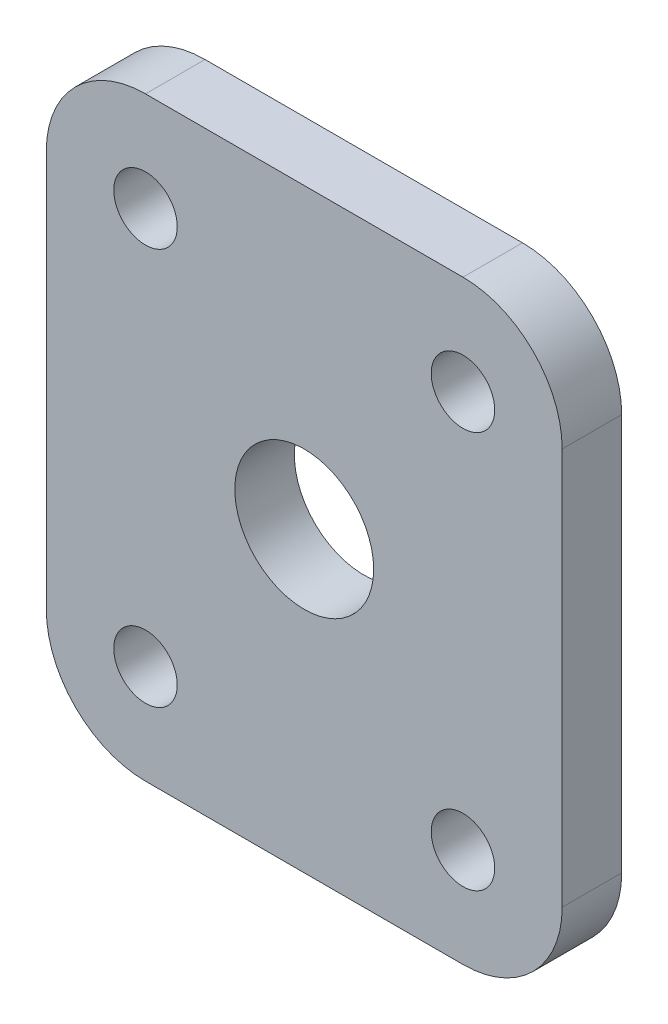
ISO-10303-21;
HEADER;
FILE_DESCRIPTION(('STEP AP214'),'2;1');
FILE_NAME('part.step','',(''),(''),'','','');
FILE_SCHEMA(('AUTOMOTIVE_DESIGN { 1 0 10303 214 1 1 1 1 }'));
ENDSEC;
DATA;
#1=APPLICATION_CONTEXT('core data for automotive mechanical design processes');
#2=APPLICATION_PROTOCOL_DEFINITION('international standard','automotive_design',2000,#1);
#3=PRODUCT_CONTEXT('',#1,'mechanical');
#4=PRODUCT('Part','Part','',(#3));
#5=PRODUCT_RELATED_PRODUCT_CATEGORY('part','',(#4));
#6=PRODUCT_DEFINITION_FORMATION('','',#4);
#7=PRODUCT_DEFINITION_CONTEXT('part definition',#1,'design');
#8=PRODUCT_DEFINITION('design','',#6,#7);
#9=PRODUCT_DEFINITION_SHAPE('','',#8);
#10=(LENGTH_UNIT() NAMED_UNIT(*) SI_UNIT(.MILLI.,.METRE.));
#11=(NAMED_UNIT(*) PLANE_ANGLE_UNIT() SI_UNIT($,.RADIAN.));
#12=(NAMED_UNIT(*) SI_UNIT($,.STERADIAN.) SOLID_ANGLE_UNIT());
#13=UNCERTAINTY_MEASURE_WITH_UNIT(LENGTH_MEASURE(1.E-05),#10,'distance_accuracy_value','');
#14=(GEOMETRIC_REPRESENTATION_CONTEXT(3) GLOBAL_UNCERTAINTY_ASSIGNED_CONTEXT((#13)) GLOBAL_UNIT_ASSIGNED_CONTEXT((#10,
#11,#12)) REPRESENTATION_CONTEXT('',''));
#15=CARTESIAN_POINT('',(0.,0.,0.));
#16=DIRECTION('',(0.,0.,1.));
#17=DIRECTION('',(1.,0.,0.));
#18=AXIS2_PLACEMENT_3D('',#15,#16,#17);
#19=CARTESIAN_POINT('',(0.,-15.,3.));
#20=DIRECTION('',(0.,1.,0.));
#21=DIRECTION('',(-1.,0.,0.));
#22=AXIS2_PLACEMENT_3D('',#19,#20,#21);
#23=PLANE('',#22);
#24=DIRECTION('',(1.,0.,0.));
#25=VECTOR('',#24,1.);
#26=CARTESIAN_POINT('',(0.,-15.,3.));
#27=LINE('',#26,#25);
#28=CARTESIAN_POINT('',(-7.99999999999999,-15.,3.));
#29=VERTEX_POINT('',#28);
#30=CARTESIAN_POINT('',(8.,-15.,3.));
#31=VERTEX_POINT('',#30);
#32=EDGE_CURVE('E126',#29,#31,#27,.T.);
#33=ORIENTED_EDGE('',*,*,#32,.F.);
#34=DIRECTION('',(0.,0.,-1.));
#35=VECTOR('',#34,1.);
#36=CARTESIAN_POINT('',(-7.99999999999999,-15.,0.));
#37=LINE('',#36,#35);
#38=CARTESIAN_POINT('',(-7.99999999999999,-15.,0.));
#39=VERTEX_POINT('',#38);
#40=EDGE_CURVE('E111',#29,#39,#37,.T.);
#41=ORIENTED_EDGE('',*,*,#40,.T.);
#42=DIRECTION('',(1.,0.,0.));
#43=VECTOR('',#42,1.);
#44=CARTESIAN_POINT('',(0.,-15.,0.));
#45=LINE('',#44,#43);
#46=CARTESIAN_POINT('',(8.,-15.,0.));
#47=VERTEX_POINT('',#46);
#48=EDGE_CURVE('E123',#39,#47,#45,.T.);
#49=ORIENTED_EDGE('',*,*,#48,.T.);
#50=DIRECTION('',(0.,0.,-1.));
#51=VECTOR('',#50,1.);
#52=CARTESIAN_POINT('',(8.,-15.,3.));
#53=LINE('',#52,#51);
#54=EDGE_CURVE('E128',#47,#31,#53,.F.);
#55=ORIENTED_EDGE('',*,*,#54,.T.);
#56=EDGE_LOOP('',(#33,#41,#49,#55));
#57=FACE_BOUND('',#56,.T.);
#58=ADVANCED_FACE('F42',(#57),#23,.F.);
#59=CARTESIAN_POINT('',(13.,0.,3.));
#60=DIRECTION('',(-1.,0.,0.));
#61=DIRECTION('',(0.,0.,1.));
#62=AXIS2_PLACEMENT_3D('',#59,#60,#61);
#63=PLANE('',#62);
#64=DIRECTION('',(0.,1.,0.));
#65=VECTOR('',#64,1.);
#66=CARTESIAN_POINT('',(13.,0.,3.));
#67=LINE('',#66,#65);
#68=CARTESIAN_POINT('',(13.,-10.,3.));
#69=VERTEX_POINT('',#68);
#70=CARTESIAN_POINT('',(13.,10.,3.));
#71=VERTEX_POINT('',#70);
#72=EDGE_CURVE('E179',#69,#71,#67,.T.);
#73=ORIENTED_EDGE('',*,*,#72,.F.);
#74=DIRECTION('',(0.,0.,-1.));
#75=VECTOR('',#74,1.);
#76=CARTESIAN_POINT('',(13.,-10.,3.));
#77=LINE('',#76,#75);
#78=CARTESIAN_POINT('',(13.,-10.,0.));
#79=VERTEX_POINT('',#78);
#80=EDGE_CURVE('E201',#69,#79,#77,.T.);
#81=ORIENTED_EDGE('',*,*,#80,.T.);
#82=DIRECTION('',(0.,1.,0.));
#83=VECTOR('',#82,1.);
#84=CARTESIAN_POINT('',(13.,0.,0.));
#85=LINE('',#84,#83);
#86=CARTESIAN_POINT('',(13.,10.,0.));
#87=VERTEX_POINT('',#86);
#88=EDGE_CURVE('E133',#79,#87,#85,.T.);
#89=ORIENTED_EDGE('',*,*,#88,.T.);
#90=DIRECTION('',(0.,0.,-1.));
#91=VECTOR('',#90,1.);
#92=CARTESIAN_POINT('',(13.,10.,3.));
#93=LINE('',#92,#91);
#94=EDGE_CURVE('E197',#87,#71,#93,.F.);
#95=ORIENTED_EDGE('',*,*,#94,.T.);
#96=EDGE_LOOP('',(#73,#81,#89,#95));
#97=FACE_BOUND('',#96,.T.);
#98=ADVANCED_FACE('F221',(#97),#63,.F.);
#99=CARTESIAN_POINT('',(0.,15.,3.));
#100=DIRECTION('',(0.,1.,0.));
#101=DIRECTION('',(-1.,0.,0.));
#102=AXIS2_PLACEMENT_3D('',#99,#100,#101);
#103=PLANE('',#102);
#104=DIRECTION('',(1.,0.,0.));
#105=VECTOR('',#104,1.);
#106=CARTESIAN_POINT('',(0.,15.,0.));
#107=LINE('',#106,#105);
#108=CARTESIAN_POINT('',(-8.,15.,0.));
#109=VERTEX_POINT('',#108);
#110=CARTESIAN_POINT('',(8.,15.,0.));
#111=VERTEX_POINT('',#110);
#112=EDGE_CURVE('E137',#109,#111,#107,.T.);
#113=ORIENTED_EDGE('',*,*,#112,.F.);
#114=DIRECTION('',(0.,0.,-1.));
#115=VECTOR('',#114,1.);
#116=CARTESIAN_POINT('',(-8.,15.,3.));
#117=LINE('',#116,#115);
#118=CARTESIAN_POINT('',(-8.,15.,3.));
#119=VERTEX_POINT('',#118);
#120=EDGE_CURVE('E12',#109,#119,#117,.F.);
#121=ORIENTED_EDGE('',*,*,#120,.T.);
#122=DIRECTION('',(1.,0.,0.));
#123=VECTOR('',#122,1.);
#124=CARTESIAN_POINT('',(0.,15.,3.));
#125=LINE('',#124,#123);
#126=CARTESIAN_POINT('',(8.,15.,3.));
#127=VERTEX_POINT('',#126);
#128=EDGE_CURVE('E175',#119,#127,#125,.T.);
#129=ORIENTED_EDGE('',*,*,#128,.T.);
#130=DIRECTION('',(0.,0.,-1.));
#131=VECTOR('',#130,1.);
#132=CARTESIAN_POINT('',(8.,15.,0.));
#133=LINE('',#132,#131);
#134=EDGE_CURVE('E50',#127,#111,#133,.T.);
#135=ORIENTED_EDGE('',*,*,#134,.T.);
#136=EDGE_LOOP('',(#113,#121,#129,#135));
#137=FACE_BOUND('',#136,.T.);
#138=ADVANCED_FACE('F205',(#137),#103,.T.);
#139=CARTESIAN_POINT('',(8.,-10.,3.));
#140=DIRECTION('',(0.,0.,-1.));
#141=DIRECTION('',(-1.,0.,0.));
#142=AXIS2_PLACEMENT_3D('',#139,#140,#141);
#143=CYLINDRICAL_SURFACE('',#142,1.6);
#144=CARTESIAN_POINT('',(8.,-10.,3.));
#145=DIRECTION('',(0.,0.,1.));
#146=DIRECTION('',(1.,0.,0.));
#147=AXIS2_PLACEMENT_3D('',#144,#145,#146);
#148=CIRCLE('',#147,1.6);
#149=CARTESIAN_POINT('',(9.6,-10.,3.));
#150=VERTEX_POINT('',#149);
#151=EDGE_CURVE('E184',#150,#150,#148,.T.);
#152=ORIENTED_EDGE('',*,*,#151,.T.);
#153=EDGE_LOOP('',(#152));
#154=FACE_BOUND('',#153,.T.);
#155=CARTESIAN_POINT('',(8.,-10.,0.));
#156=DIRECTION('',(0.,0.,1.));
#157=DIRECTION('',(1.,0.,0.));
#158=AXIS2_PLACEMENT_3D('',#155,#156,#157);
#159=CIRCLE('',#158,1.6);
#160=CARTESIAN_POINT('',(9.6,-10.,0.));
#161=VERTEX_POINT('',#160);
#162=EDGE_CURVE('E148',#161,#161,#159,.T.);
#163=ORIENTED_EDGE('',*,*,#162,.F.);
#164=EDGE_LOOP('',(#163));
#165=FACE_BOUND('',#164,.T.);
#166=ADVANCED_FACE('F271',(#154,#165),#143,.F.);
#167=CARTESIAN_POINT('',(-13.,0.,3.));
#168=DIRECTION('',(-1.,0.,0.));
#169=DIRECTION('',(0.,-1.,0.));
#170=AXIS2_PLACEMENT_3D('',#167,#168,#169);
#171=PLANE('',#170);
#172=DIRECTION('',(0.,1.,0.));
#173=VECTOR('',#172,1.);
#174=CARTESIAN_POINT('',(-13.,0.,0.));
#175=LINE('',#174,#173);
#176=CARTESIAN_POINT('',(-13.,-10.,0.));
#177=VERTEX_POINT('',#176);
#178=CARTESIAN_POINT('',(-13.,10.,0.));
#179=VERTEX_POINT('',#178);
#180=EDGE_CURVE('E146',#177,#179,#175,.T.);
#181=ORIENTED_EDGE('',*,*,#180,.F.);
#182=DIRECTION('',(0.,0.,-1.));
#183=VECTOR('',#182,1.);
#184=CARTESIAN_POINT('',(-13.,-10.,3.));
#185=LINE('',#184,#183);
#186=CARTESIAN_POINT('',(-13.,-10.,3.));
#187=VERTEX_POINT('',#186);
#188=EDGE_CURVE('E112',#177,#187,#185,.F.);
#189=ORIENTED_EDGE('',*,*,#188,.T.);
#190=DIRECTION('',(0.,1.,0.));
#191=VECTOR('',#190,1.);
#192=CARTESIAN_POINT('',(-13.,0.,3.));
#193=LINE('',#192,#191);
#194=CARTESIAN_POINT('',(-13.,10.,3.));
#195=VERTEX_POINT('',#194);
#196=EDGE_CURVE('E178',#187,#195,#193,.T.);
#197=ORIENTED_EDGE('',*,*,#196,.T.);
#198=DIRECTION('',(0.,0.,-1.));
#199=VECTOR('',#198,1.);
#200=CARTESIAN_POINT('',(-13.,10.,3.));
#201=LINE('',#200,#199);
#202=EDGE_CURVE('E117',#195,#179,#201,.T.);
#203=ORIENTED_EDGE('',*,*,#202,.T.);
#204=EDGE_LOOP('',(#181,#189,#197,#203));
#205=FACE_BOUND('',#204,.T.);
#206=ADVANCED_FACE('F212',(#205),#171,.T.);
#207=CARTESIAN_POINT('',(-8.,10.,3.));
#208=DIRECTION('',(0.,0.,-1.));
#209=DIRECTION('',(-1.,0.,0.));
#210=AXIS2_PLACEMENT_3D('',#207,#208,#209);
#211=CYLINDRICAL_SURFACE('',#210,1.6);
#212=CARTESIAN_POINT('',(-8.,10.,3.));
#213=DIRECTION('',(0.,0.,1.));
#214=DIRECTION('',(1.,0.,0.));
#215=AXIS2_PLACEMENT_3D('',#212,#213,#214);
#216=CIRCLE('',#215,1.6);
#217=CARTESIAN_POINT('',(-6.4,10.,3.));
#218=VERTEX_POINT('',#217);
#219=EDGE_CURVE('E381',#218,#218,#216,.T.);
#220=ORIENTED_EDGE('',*,*,#219,.T.);
#221=EDGE_LOOP('',(#220));
#222=FACE_BOUND('',#221,.T.);
#223=CARTESIAN_POINT('',(-8.,10.,0.));
#224=DIRECTION('',(0.,0.,1.));
#225=DIRECTION('',(1.,0.,0.));
#226=AXIS2_PLACEMENT_3D('',#223,#224,#225);
#227=CIRCLE('',#226,1.6);
#228=CARTESIAN_POINT('',(-6.4,10.,0.));
#229=VERTEX_POINT('',#228);
#230=EDGE_CURVE('E134',#229,#229,#227,.T.);
#231=ORIENTED_EDGE('',*,*,#230,.F.);
#232=EDGE_LOOP('',(#231));
#233=FACE_BOUND('',#232,.T.);
#234=ADVANCED_FACE('F239',(#222,#233),#211,.F.);
#235=CARTESIAN_POINT('',(8.,10.,3.));
#236=DIRECTION('',(0.,0.,-1.));
#237=DIRECTION('',(-1.,0.,0.));
#238=AXIS2_PLACEMENT_3D('',#235,#236,#237);
#239=CYLINDRICAL_SURFACE('',#238,1.6);
#240=CARTESIAN_POINT('',(8.,10.,3.));
#241=DIRECTION('',(0.,0.,1.));
#242=DIRECTION('',(1.,0.,0.));
#243=AXIS2_PLACEMENT_3D('',#240,#241,#242);
#244=CIRCLE('',#243,1.6);
#245=CARTESIAN_POINT('',(9.6,10.,3.));
#246=VERTEX_POINT('',#245);
#247=EDGE_CURVE('E378',#246,#246,#244,.F.);
#248=ORIENTED_EDGE('',*,*,#247,.F.);
#249=EDGE_LOOP('',(#248));
#250=FACE_BOUND('',#249,.T.);
#251=CARTESIAN_POINT('',(8.,10.,0.));
#252=DIRECTION('',(0.,0.,1.));
#253=DIRECTION('',(1.,0.,0.));
#254=AXIS2_PLACEMENT_3D('',#251,#252,#253);
#255=CIRCLE('',#254,1.6);
#256=CARTESIAN_POINT('',(9.6,10.,0.));
#257=VERTEX_POINT('',#256);
#258=EDGE_CURVE('E140',#257,#257,#255,.F.);
#259=ORIENTED_EDGE('',*,*,#258,.T.);
#260=EDGE_LOOP('',(#259));
#261=FACE_BOUND('',#260,.T.);
#262=ADVANCED_FACE('F242',(#250,#261),#239,.F.);
#263=CARTESIAN_POINT('',(0.,0.,3.));
#264=DIRECTION('',(0.,0.,-1.));
#265=DIRECTION('',(-1.,0.,0.));
#266=AXIS2_PLACEMENT_3D('',#263,#264,#265);
#267=CYLINDRICAL_SURFACE('',#266,3.5);
#268=CARTESIAN_POINT('',(0.,0.,3.));
#269=DIRECTION('',(0.,0.,1.));
#270=DIRECTION('',(1.,0.,0.));
#271=AXIS2_PLACEMENT_3D('',#268,#269,#270);
#272=CIRCLE('',#271,3.5);
#273=CARTESIAN_POINT('',(3.5,0.,3.));
#274=VERTEX_POINT('',#273);
#275=EDGE_CURVE('E154',#274,#274,#272,.T.);
#276=ORIENTED_EDGE('',*,*,#275,.T.);
#277=EDGE_LOOP('',(#276));
#278=FACE_BOUND('',#277,.T.);
#279=CARTESIAN_POINT('',(0.,0.,0.));
#280=DIRECTION('',(0.,0.,1.));
#281=DIRECTION('',(1.,0.,0.));
#282=AXIS2_PLACEMENT_3D('',#279,#280,#281);
#283=CIRCLE('',#282,3.5);
#284=CARTESIAN_POINT('',(3.5,0.,0.));
#285=VERTEX_POINT('',#284);
#286=EDGE_CURVE('E261',#285,#285,#283,.T.);
#287=ORIENTED_EDGE('',*,*,#286,.F.);
#288=EDGE_LOOP('',(#287));
#289=FACE_BOUND('',#288,.T.);
#290=ADVANCED_FACE('F246',(#278,#289),#267,.F.);
#291=CARTESIAN_POINT('',(-8.,-10.,3.));
#292=DIRECTION('',(0.,0.,-1.));
#293=DIRECTION('',(-1.,0.,0.));
#294=AXIS2_PLACEMENT_3D('',#291,#292,#293);
#295=CYLINDRICAL_SURFACE('',#294,1.6);
#296=CARTESIAN_POINT('',(-8.,-10.,3.));
#297=DIRECTION('',(0.,0.,1.));
#298=DIRECTION('',(1.,0.,0.));
#299=AXIS2_PLACEMENT_3D('',#296,#297,#298);
#300=CIRCLE('',#299,1.6);
#301=CARTESIAN_POINT('',(-6.4,-10.,3.));
#302=VERTEX_POINT('',#301);
#303=EDGE_CURVE('E155',#302,#302,#300,.F.);
#304=ORIENTED_EDGE('',*,*,#303,.F.);
#305=EDGE_LOOP('',(#304));
#306=FACE_BOUND('',#305,.T.);
#307=CARTESIAN_POINT('',(-8.,-10.,0.));
#308=DIRECTION('',(0.,0.,1.));
#309=DIRECTION('',(1.,0.,0.));
#310=AXIS2_PLACEMENT_3D('',#307,#308,#309);
#311=CIRCLE('',#310,1.6);
#312=CARTESIAN_POINT('',(-6.4,-10.,0.));
#313=VERTEX_POINT('',#312);
#314=EDGE_CURVE('E151',#313,#313,#311,.F.);
#315=ORIENTED_EDGE('',*,*,#314,.T.);
#316=EDGE_LOOP('',(#315));
#317=FACE_BOUND('',#316,.T.);
#318=ADVANCED_FACE('F249',(#306,#317),#295,.F.);
#319=CARTESIAN_POINT('',(0.,0.,3.));
#320=DIRECTION('',(0.,0.,1.));
#321=DIRECTION('',(1.,0.,0.));
#322=AXIS2_PLACEMENT_3D('',#319,#320,#321);
#323=PLANE('',#322);
#324=ORIENTED_EDGE('',*,*,#275,.F.);
#325=EDGE_LOOP('',(#324));
#326=FACE_BOUND('',#325,.T.);
#327=ORIENTED_EDGE('',*,*,#247,.T.);
#328=EDGE_LOOP('',(#327));
#329=FACE_BOUND('',#328,.T.);
#330=ORIENTED_EDGE('',*,*,#219,.F.);
#331=EDGE_LOOP('',(#330));
#332=FACE_BOUND('',#331,.T.);
#333=ORIENTED_EDGE('',*,*,#196,.F.);
#334=CARTESIAN_POINT('',(-7.99999999999999,-10.,3.));
#335=DIRECTION('',(0.,0.,1.));
#336=DIRECTION('',(1.,0.,0.));
#337=AXIS2_PLACEMENT_3D('',#334,#335,#336);
#338=CIRCLE('',#337,5.);
#339=EDGE_CURVE('E194',#187,#29,#338,.T.);
#340=ORIENTED_EDGE('',*,*,#339,.T.);
#341=ORIENTED_EDGE('',*,*,#32,.T.);
#342=CARTESIAN_POINT('',(8.,-10.,3.));
#343=DIRECTION('',(0.,0.,1.));
#344=DIRECTION('',(1.,0.,0.));
#345=AXIS2_PLACEMENT_3D('',#342,#343,#344);
#346=CIRCLE('',#345,5.);
#347=EDGE_CURVE('E198',#31,#69,#346,.T.);
#348=ORIENTED_EDGE('',*,*,#347,.T.);
#349=ORIENTED_EDGE('',*,*,#72,.T.);
#350=CARTESIAN_POINT('',(8.,10.,3.));
#351=DIRECTION('',(0.,0.,1.));
#352=DIRECTION('',(1.,0.,0.));
#353=AXIS2_PLACEMENT_3D('',#350,#351,#352);
#354=CIRCLE('',#353,5.);
#355=EDGE_CURVE('E57',#71,#127,#354,.T.);
#356=ORIENTED_EDGE('',*,*,#355,.T.);
#357=ORIENTED_EDGE('',*,*,#128,.F.);
#358=CARTESIAN_POINT('',(-8.,10.,3.));
#359=DIRECTION('',(0.,0.,1.));
#360=DIRECTION('',(1.,0.,0.));
#361=AXIS2_PLACEMENT_3D('',#358,#359,#360);
#362=CIRCLE('',#361,5.);
#363=EDGE_CURVE('E166',#119,#195,#362,.T.);
#364=ORIENTED_EDGE('',*,*,#363,.T.);
#365=EDGE_LOOP('',(#333,#340,#341,#348,#349,#356,#357,#364));
#366=FACE_BOUND('',#365,.T.);
#367=ORIENTED_EDGE('',*,*,#151,.F.);
#368=EDGE_LOOP('',(#367));
#369=FACE_BOUND('',#368,.T.);
#370=ORIENTED_EDGE('',*,*,#303,.T.);
#371=EDGE_LOOP('',(#370));
#372=FACE_BOUND('',#371,.T.);
#373=ADVANCED_FACE('F214',(#326,#329,#332,#366,#369,#372),#323,.T.);
#374=CARTESIAN_POINT('',(0.,0.,0.));
#375=DIRECTION('',(0.,0.,1.));
#376=DIRECTION('',(1.,0.,0.));
#377=AXIS2_PLACEMENT_3D('',#374,#375,#376);
#378=PLANE('',#377);
#379=ORIENTED_EDGE('',*,*,#286,.T.);
#380=EDGE_LOOP('',(#379));
#381=FACE_BOUND('',#380,.T.);
#382=ORIENTED_EDGE('',*,*,#258,.F.);
#383=EDGE_LOOP('',(#382));
#384=FACE_BOUND('',#383,.T.);
#385=ORIENTED_EDGE('',*,*,#230,.T.);
#386=EDGE_LOOP('',(#385));
#387=FACE_BOUND('',#386,.T.);
#388=ORIENTED_EDGE('',*,*,#48,.F.);
#389=CARTESIAN_POINT('',(-7.99999999999999,-10.,0.));
#390=DIRECTION('',(0.,0.,1.));
#391=DIRECTION('',(1.,0.,0.));
#392=AXIS2_PLACEMENT_3D('',#389,#390,#391);
#393=CIRCLE('',#392,5.);
#394=EDGE_CURVE('E107',#39,#177,#393,.F.);
#395=ORIENTED_EDGE('',*,*,#394,.T.);
#396=ORIENTED_EDGE('',*,*,#180,.T.);
#397=CARTESIAN_POINT('',(-8.,10.,0.));
#398=DIRECTION('',(0.,0.,1.));
#399=DIRECTION('',(1.,0.,0.));
#400=AXIS2_PLACEMENT_3D('',#397,#398,#399);
#401=CIRCLE('',#400,5.);
#402=EDGE_CURVE('E158',#179,#109,#401,.F.);
#403=ORIENTED_EDGE('',*,*,#402,.T.);
#404=ORIENTED_EDGE('',*,*,#112,.T.);
#405=CARTESIAN_POINT('',(8.,10.,0.));
#406=DIRECTION('',(0.,0.,1.));
#407=DIRECTION('',(1.,0.,0.));
#408=AXIS2_PLACEMENT_3D('',#405,#406,#407);
#409=CIRCLE('',#408,5.);
#410=EDGE_CURVE('E127',#111,#87,#409,.F.);
#411=ORIENTED_EDGE('',*,*,#410,.T.);
#412=ORIENTED_EDGE('',*,*,#88,.F.);
#413=CARTESIAN_POINT('',(8.,-10.,0.));
#414=DIRECTION('',(0.,0.,1.));
#415=DIRECTION('',(1.,0.,0.));
#416=AXIS2_PLACEMENT_3D('',#413,#414,#415);
#417=CIRCLE('',#416,5.);
#418=EDGE_CURVE('E118',#79,#47,#417,.F.);
#419=ORIENTED_EDGE('',*,*,#418,.T.);
#420=EDGE_LOOP('',(#388,#395,#396,#403,#404,#411,#412,#419));
#421=FACE_BOUND('',#420,.T.);
#422=ORIENTED_EDGE('',*,*,#162,.T.);
#423=EDGE_LOOP('',(#422));
#424=FACE_BOUND('',#423,.T.);
#425=ORIENTED_EDGE('',*,*,#314,.F.);
#426=EDGE_LOOP('',(#425));
#427=FACE_BOUND('',#426,.T.);
#428=ADVANCED_FACE('F130',(#381,#384,#387,#421,#424,#427),#378,.F.);
#429=CARTESIAN_POINT('',(-7.99999999999999,-10.,3.));
#430=DIRECTION('',(0.,0.,1.));
#431=DIRECTION('',(1.,0.,0.));
#432=AXIS2_PLACEMENT_3D('',#429,#430,#431);
#433=CYLINDRICAL_SURFACE('',#432,5.);
#434=ORIENTED_EDGE('',*,*,#339,.F.);
#435=ORIENTED_EDGE('',*,*,#188,.F.);
#436=ORIENTED_EDGE('',*,*,#394,.F.);
#437=ORIENTED_EDGE('',*,*,#40,.F.);
#438=EDGE_LOOP('',(#434,#435,#436,#437));
#439=FACE_BOUND('',#438,.T.);
#440=ADVANCED_FACE('F110',(#439),#433,.T.);
#441=CARTESIAN_POINT('',(8.,-10.,3.));
#442=DIRECTION('',(0.,0.,-1.));
#443=DIRECTION('',(-1.,0.,0.));
#444=AXIS2_PLACEMENT_3D('',#441,#442,#443);
#445=CYLINDRICAL_SURFACE('',#444,5.);
#446=ORIENTED_EDGE('',*,*,#347,.F.);
#447=ORIENTED_EDGE('',*,*,#54,.F.);
#448=ORIENTED_EDGE('',*,*,#418,.F.);
#449=ORIENTED_EDGE('',*,*,#80,.F.);
#450=EDGE_LOOP('',(#446,#447,#448,#449));
#451=FACE_BOUND('',#450,.T.);
#452=ADVANCED_FACE('F223',(#451),#445,.T.);
#453=CARTESIAN_POINT('',(-8.,10.,3.));
#454=DIRECTION('',(0.,0.,-1.));
#455=DIRECTION('',(-1.,0.,0.));
#456=AXIS2_PLACEMENT_3D('',#453,#454,#455);
#457=CYLINDRICAL_SURFACE('',#456,5.);
#458=ORIENTED_EDGE('',*,*,#363,.F.);
#459=ORIENTED_EDGE('',*,*,#120,.F.);
#460=ORIENTED_EDGE('',*,*,#402,.F.);
#461=ORIENTED_EDGE('',*,*,#202,.F.);
#462=EDGE_LOOP('',(#458,#459,#460,#461));
#463=FACE_BOUND('',#462,.T.);
#464=ADVANCED_FACE('F210',(#463),#457,.T.);
#465=CARTESIAN_POINT('',(8.,10.,3.));
#466=DIRECTION('',(0.,0.,1.));
#467=DIRECTION('',(1.,0.,0.));
#468=AXIS2_PLACEMENT_3D('',#465,#466,#467);
#469=CYLINDRICAL_SURFACE('',#468,5.);
#470=ORIENTED_EDGE('',*,*,#355,.F.);
#471=ORIENTED_EDGE('',*,*,#94,.F.);
#472=ORIENTED_EDGE('',*,*,#410,.F.);
#473=ORIENTED_EDGE('',*,*,#134,.F.);
#474=EDGE_LOOP('',(#470,#471,#472,#473));
#475=FACE_BOUND('',#474,.T.);
#476=ADVANCED_FACE('F44',(#475),#469,.T.);
#477=CLOSED_SHELL('',(#58,#98,#138,#166,#206,#234,#262,#290,#318,#373,#428,#440,#452,#464,#476));
#478=MANIFOLD_SOLID_BREP('B2',#477);
#479=ADVANCED_BREP_SHAPE_REPRESENTATION('',(#18,#478),#14);
#480=SHAPE_DEFINITION_REPRESENTATION(#9,#479);
ENDSEC;
END-ISO-10303-21;
